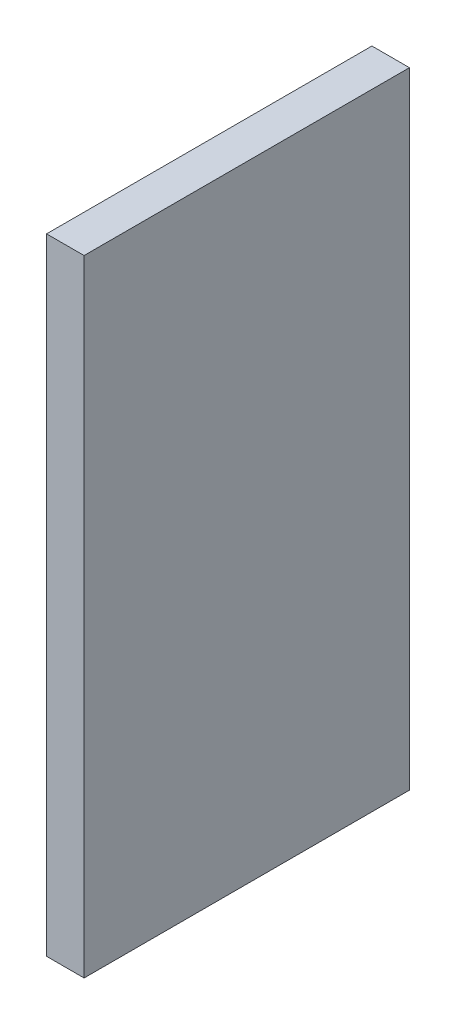
ISO-10303-21;
HEADER;
FILE_DESCRIPTION(('STEP AP214'),'2;1');
FILE_NAME('part.step','',(''),(''),'','','');
FILE_SCHEMA(('AUTOMOTIVE_DESIGN { 1 0 10303 214 1 1 1 1 }'));
ENDSEC;
DATA;
#1=APPLICATION_CONTEXT('core data for automotive mechanical design processes');
#2=APPLICATION_PROTOCOL_DEFINITION('international standard','automotive_design',2000,#1);
#3=PRODUCT_CONTEXT('',#1,'mechanical');
#4=PRODUCT('Part','Part','',(#3));
#5=PRODUCT_RELATED_PRODUCT_CATEGORY('part','',(#4));
#6=PRODUCT_DEFINITION_FORMATION('','',#4);
#7=PRODUCT_DEFINITION_CONTEXT('part definition',#1,'design');
#8=PRODUCT_DEFINITION('design','',#6,#7);
#9=PRODUCT_DEFINITION_SHAPE('','',#8);
#10=(LENGTH_UNIT() NAMED_UNIT(*) SI_UNIT(.MILLI.,.METRE.));
#11=(NAMED_UNIT(*) PLANE_ANGLE_UNIT() SI_UNIT($,.RADIAN.));
#12=(NAMED_UNIT(*) SI_UNIT($,.STERADIAN.) SOLID_ANGLE_UNIT());
#13=UNCERTAINTY_MEASURE_WITH_UNIT(LENGTH_MEASURE(1.E-05),#10,'distance_accuracy_value','');
#14=(GEOMETRIC_REPRESENTATION_CONTEXT(3) GLOBAL_UNCERTAINTY_ASSIGNED_CONTEXT((#13)) GLOBAL_UNIT_ASSIGNED_CONTEXT((#10,
#11,#12)) REPRESENTATION_CONTEXT('',''));
#15=CARTESIAN_POINT('',(0.,0.,0.));
#16=DIRECTION('',(0.,0.,1.));
#17=DIRECTION('',(1.,0.,0.));
#18=AXIS2_PLACEMENT_3D('',#15,#16,#17);
#19=CARTESIAN_POINT('',(3.,0.,0.));
#20=DIRECTION('',(0.,0.,1.));
#21=DIRECTION('',(0.,-1.,0.));
#22=AXIS2_PLACEMENT_3D('',#19,#20,#21);
#23=PLANE('',#22);
#24=DIRECTION('',(0.,1.,0.));
#25=VECTOR('',#24,1.);
#26=CARTESIAN_POINT('',(0.,0.,0.));
#27=LINE('',#26,#25);
#28=CARTESIAN_POINT('',(0.,0.,0.));
#29=VERTEX_POINT('',#28);
#30=CARTESIAN_POINT('',(0.,50.,0.));
#31=VERTEX_POINT('',#30);
#32=EDGE_CURVE('E96',#29,#31,#27,.T.);
#33=ORIENTED_EDGE('',*,*,#32,.T.);
#34=DIRECTION('',(-1.,0.,0.));
#35=VECTOR('',#34,1.);
#36=CARTESIAN_POINT('',(3.,50.,0.));
#37=LINE('',#36,#35);
#38=CARTESIAN_POINT('',(3.,50.,0.));
#39=VERTEX_POINT('',#38);
#40=EDGE_CURVE('E11',#39,#31,#37,.T.);
#41=ORIENTED_EDGE('',*,*,#40,.F.);
#42=DIRECTION('',(0.,1.,0.));
#43=VECTOR('',#42,1.);
#44=CARTESIAN_POINT('',(3.,0.,0.));
#45=LINE('',#44,#43);
#46=CARTESIAN_POINT('',(3.,0.,0.));
#47=VERTEX_POINT('',#46);
#48=EDGE_CURVE('E84',#47,#39,#45,.T.);
#49=ORIENTED_EDGE('',*,*,#48,.F.);
#50=DIRECTION('',(-1.,0.,0.));
#51=VECTOR('',#50,1.);
#52=CARTESIAN_POINT('',(3.,0.,0.));
#53=LINE('',#52,#51);
#54=EDGE_CURVE('E92',#47,#29,#53,.T.);
#55=ORIENTED_EDGE('',*,*,#54,.T.);
#56=EDGE_LOOP('',(#33,#41,#49,#55));
#57=FACE_BOUND('',#56,.T.);
#58=ADVANCED_FACE('F33',(#57),#23,.F.);
#59=CARTESIAN_POINT('',(3.,50.,0.));
#60=DIRECTION('',(0.,-1.,0.));
#61=DIRECTION('',(0.,0.,-1.));
#62=AXIS2_PLACEMENT_3D('',#59,#60,#61);
#63=PLANE('',#62);
#64=DIRECTION('',(0.,0.,1.));
#65=VECTOR('',#64,1.);
#66=CARTESIAN_POINT('',(0.,50.,0.));
#67=LINE('',#66,#65);
#68=CARTESIAN_POINT('',(0.,50.,26.));
#69=VERTEX_POINT('',#68);
#70=EDGE_CURVE('E88',#31,#69,#67,.T.);
#71=ORIENTED_EDGE('',*,*,#70,.T.);
#72=DIRECTION('',(-1.,0.,0.));
#73=VECTOR('',#72,1.);
#74=CARTESIAN_POINT('',(3.,50.,26.));
#75=LINE('',#74,#73);
#76=CARTESIAN_POINT('',(3.,50.,26.));
#77=VERTEX_POINT('',#76);
#78=EDGE_CURVE('E41',#77,#69,#75,.T.);
#79=ORIENTED_EDGE('',*,*,#78,.F.);
#80=DIRECTION('',(0.,0.,1.));
#81=VECTOR('',#80,1.);
#82=CARTESIAN_POINT('',(3.,50.,0.));
#83=LINE('',#82,#81);
#84=EDGE_CURVE('E79',#39,#77,#83,.T.);
#85=ORIENTED_EDGE('',*,*,#84,.F.);
#86=ORIENTED_EDGE('',*,*,#40,.T.);
#87=EDGE_LOOP('',(#71,#79,#85,#86));
#88=FACE_BOUND('',#87,.T.);
#89=ADVANCED_FACE('F87',(#88),#63,.F.);
#90=CARTESIAN_POINT('',(3.,0.,26.));
#91=DIRECTION('',(0.,0.,-1.));
#92=DIRECTION('',(-1.,0.,0.));
#93=AXIS2_PLACEMENT_3D('',#90,#91,#92);
#94=PLANE('',#93);
#95=DIRECTION('',(0.,-1.,0.));
#96=VECTOR('',#95,1.);
#97=CARTESIAN_POINT('',(0.,0.,26.));
#98=LINE('',#97,#96);
#99=CARTESIAN_POINT('',(0.,0.,26.));
#100=VERTEX_POINT('',#99);
#101=EDGE_CURVE('E66',#69,#100,#98,.T.);
#102=ORIENTED_EDGE('',*,*,#101,.T.);
#103=DIRECTION('',(-1.,0.,0.));
#104=VECTOR('',#103,1.);
#105=CARTESIAN_POINT('',(3.,0.,26.));
#106=LINE('',#105,#104);
#107=CARTESIAN_POINT('',(3.,0.,26.));
#108=VERTEX_POINT('',#107);
#109=EDGE_CURVE('E89',#108,#100,#106,.T.);
#110=ORIENTED_EDGE('',*,*,#109,.F.);
#111=DIRECTION('',(0.,-1.,0.));
#112=VECTOR('',#111,1.);
#113=CARTESIAN_POINT('',(3.,0.,26.));
#114=LINE('',#113,#112);
#115=EDGE_CURVE('E82',#77,#108,#114,.T.);
#116=ORIENTED_EDGE('',*,*,#115,.F.);
#117=ORIENTED_EDGE('',*,*,#78,.T.);
#118=EDGE_LOOP('',(#102,#110,#116,#117));
#119=FACE_BOUND('',#118,.T.);
#120=ADVANCED_FACE('F90',(#119),#94,.F.);
#121=CARTESIAN_POINT('',(3.,0.,0.));
#122=DIRECTION('',(0.,1.,0.));
#123=DIRECTION('',(0.,0.,1.));
#124=AXIS2_PLACEMENT_3D('',#121,#122,#123);
#125=PLANE('',#124);
#126=DIRECTION('',(0.,0.,-1.));
#127=VECTOR('',#126,1.);
#128=CARTESIAN_POINT('',(0.,0.,0.));
#129=LINE('',#128,#127);
#130=EDGE_CURVE('E72',#100,#29,#129,.T.);
#131=ORIENTED_EDGE('',*,*,#130,.T.);
#132=ORIENTED_EDGE('',*,*,#54,.F.);
#133=DIRECTION('',(0.,0.,-1.));
#134=VECTOR('',#133,1.);
#135=CARTESIAN_POINT('',(3.,0.,0.));
#136=LINE('',#135,#134);
#137=EDGE_CURVE('E49',#108,#47,#136,.T.);
#138=ORIENTED_EDGE('',*,*,#137,.F.);
#139=ORIENTED_EDGE('',*,*,#109,.T.);
#140=EDGE_LOOP('',(#131,#132,#138,#139));
#141=FACE_BOUND('',#140,.T.);
#142=ADVANCED_FACE('F103',(#141),#125,.F.);
#143=CARTESIAN_POINT('',(3.,0.,0.));
#144=DIRECTION('',(1.,0.,0.));
#145=DIRECTION('',(0.,0.,-1.));
#146=AXIS2_PLACEMENT_3D('',#143,#144,#145);
#147=PLANE('',#146);
#148=ORIENTED_EDGE('',*,*,#48,.T.);
#149=ORIENTED_EDGE('',*,*,#84,.T.);
#150=ORIENTED_EDGE('',*,*,#115,.T.);
#151=ORIENTED_EDGE('',*,*,#137,.T.);
#152=EDGE_LOOP('',(#148,#149,#150,#151));
#153=FACE_BOUND('',#152,.T.);
#154=ADVANCED_FACE('F80',(#153),#147,.T.);
#155=CARTESIAN_POINT('',(0.,0.,0.));
#156=DIRECTION('',(1.,0.,0.));
#157=DIRECTION('',(0.,0.,-1.));
#158=AXIS2_PLACEMENT_3D('',#155,#156,#157);
#159=PLANE('',#158);
#160=ORIENTED_EDGE('',*,*,#32,.F.);
#161=ORIENTED_EDGE('',*,*,#130,.F.);
#162=ORIENTED_EDGE('',*,*,#101,.F.);
#163=ORIENTED_EDGE('',*,*,#70,.F.);
#164=EDGE_LOOP('',(#160,#161,#162,#163));
#165=FACE_BOUND('',#164,.T.);
#166=ADVANCED_FACE('F106',(#165),#159,.F.);
#167=CLOSED_SHELL('',(#58,#89,#120,#142,#154,#166));
#168=MANIFOLD_SOLID_BREP('B2',#167);
#169=ADVANCED_BREP_SHAPE_REPRESENTATION('',(#18,#168),#14);
#170=SHAPE_DEFINITION_REPRESENTATION(#9,#169);
ENDSEC;
END-ISO-10303-21;
